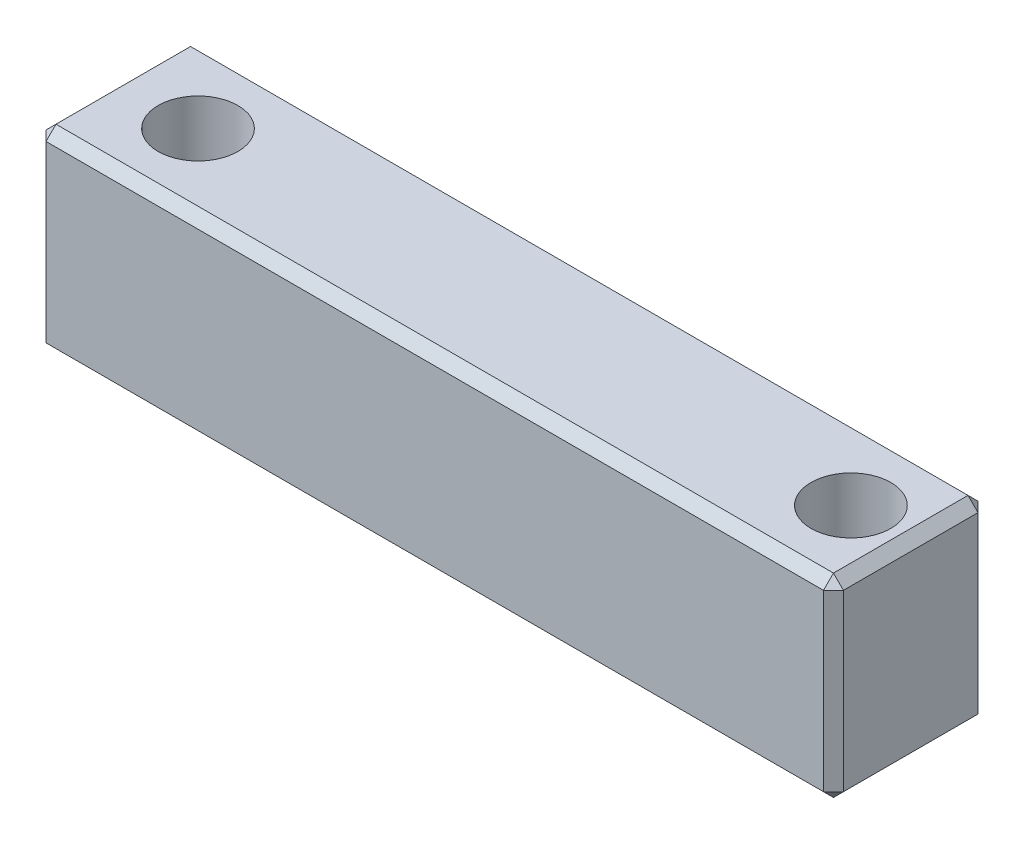
ISO-10303-21;
HEADER;
FILE_DESCRIPTION(('STEP AP214'),'2;1');
FILE_NAME('part.step','',(''),(''),'','','');
FILE_SCHEMA(('AUTOMOTIVE_DESIGN { 1 0 10303 214 1 1 1 1 }'));
ENDSEC;
DATA;
#1=APPLICATION_CONTEXT('core data for automotive mechanical design processes');
#2=APPLICATION_PROTOCOL_DEFINITION('international standard','automotive_design',2000,#1);
#3=PRODUCT_CONTEXT('',#1,'mechanical');
#4=PRODUCT('Part','Part','',(#3));
#5=PRODUCT_RELATED_PRODUCT_CATEGORY('part','',(#4));
#6=PRODUCT_DEFINITION_FORMATION('','',#4);
#7=PRODUCT_DEFINITION_CONTEXT('part definition',#1,'design');
#8=PRODUCT_DEFINITION('design','',#6,#7);
#9=PRODUCT_DEFINITION_SHAPE('','',#8);
#10=(LENGTH_UNIT() NAMED_UNIT(*) SI_UNIT(.MILLI.,.METRE.));
#11=(NAMED_UNIT(*) PLANE_ANGLE_UNIT() SI_UNIT($,.RADIAN.));
#12=(NAMED_UNIT(*) SI_UNIT($,.STERADIAN.) SOLID_ANGLE_UNIT());
#13=UNCERTAINTY_MEASURE_WITH_UNIT(LENGTH_MEASURE(1.E-05),#10,'distance_accuracy_value','');
#14=(GEOMETRIC_REPRESENTATION_CONTEXT(3) GLOBAL_UNCERTAINTY_ASSIGNED_CONTEXT((#13)) GLOBAL_UNIT_ASSIGNED_CONTEXT((#10,
#11,#12)) REPRESENTATION_CONTEXT('',''));
#15=CARTESIAN_POINT('',(0.,0.,0.));
#16=DIRECTION('',(0.,0.,1.));
#17=DIRECTION('',(1.,0.,0.));
#18=AXIS2_PLACEMENT_3D('',#15,#16,#17);
#19=CARTESIAN_POINT('',(40.,0.,0.));
#20=DIRECTION('',(0.,0.,-1.));
#21=DIRECTION('',(0.,1.,0.));
#22=AXIS2_PLACEMENT_3D('',#19,#20,#21);
#23=PLANE('',#22);
#24=DIRECTION('',(1.,0.,0.));
#25=VECTOR('',#24,1.);
#26=CARTESIAN_POINT('',(40.,0.500000000000011,0.));
#27=LINE('',#26,#25);
#28=CARTESIAN_POINT('',(0.500000000000007,0.500000000000011,0.));
#29=VERTEX_POINT('',#28);
#30=CARTESIAN_POINT('',(39.5,0.500000000000011,0.));
#31=VERTEX_POINT('',#30);
#32=EDGE_CURVE('E162',#29,#31,#27,.T.);
#33=ORIENTED_EDGE('',*,*,#32,.T.);
#34=DIRECTION('',(0.,1.,0.));
#35=VECTOR('',#34,1.);
#36=CARTESIAN_POINT('',(39.5,0.,0.));
#37=LINE('',#36,#35);
#38=CARTESIAN_POINT('',(39.5,9.24999999999999,0.));
#39=VERTEX_POINT('',#38);
#40=EDGE_CURVE('E166',#31,#39,#37,.T.);
#41=ORIENTED_EDGE('',*,*,#40,.T.);
#42=DIRECTION('',(-1.,0.,0.));
#43=VECTOR('',#42,1.);
#44=CARTESIAN_POINT('',(40.,9.24999999999999,0.));
#45=LINE('',#44,#43);
#46=CARTESIAN_POINT('',(0.500000000000007,9.24999999999999,0.));
#47=VERTEX_POINT('',#46);
#48=EDGE_CURVE('E136',#39,#47,#45,.T.);
#49=ORIENTED_EDGE('',*,*,#48,.T.);
#50=DIRECTION('',(0.,-1.,0.));
#51=VECTOR('',#50,1.);
#52=CARTESIAN_POINT('',(0.500000000000007,0.,0.));
#53=LINE('',#52,#51);
#54=EDGE_CURVE('E155',#47,#29,#53,.T.);
#55=ORIENTED_EDGE('',*,*,#54,.T.);
#56=EDGE_LOOP('',(#33,#41,#49,#55));
#57=FACE_BOUND('',#56,.T.);
#58=ADVANCED_FACE('F41',(#57),#23,.F.);
#59=CARTESIAN_POINT('',(40.,0.,0.));
#60=DIRECTION('',(0.,1.,0.));
#61=DIRECTION('',(0.,0.,1.));
#62=AXIS2_PLACEMENT_3D('',#59,#60,#61);
#63=PLANE('',#62);
#64=DIRECTION('',(0.,0.,1.));
#65=VECTOR('',#64,1.);
#66=CARTESIAN_POINT('',(39.5,0.,0.));
#67=LINE('',#66,#65);
#68=CARTESIAN_POINT('',(39.5,0.,-7.24999999999999));
#69=VERTEX_POINT('',#68);
#70=CARTESIAN_POINT('',(39.5,0.,-0.500000000000007));
#71=VERTEX_POINT('',#70);
#72=EDGE_CURVE('E192',#69,#71,#67,.T.);
#73=ORIENTED_EDGE('',*,*,#72,.T.);
#74=DIRECTION('',(-1.,0.,0.));
#75=VECTOR('',#74,1.);
#76=CARTESIAN_POINT('',(40.,0.,-0.500000000000007));
#77=LINE('',#76,#75);
#78=CARTESIAN_POINT('',(0.500000000000007,0.,-0.500000000000007));
#79=VERTEX_POINT('',#78);
#80=EDGE_CURVE('E195',#71,#79,#77,.T.);
#81=ORIENTED_EDGE('',*,*,#80,.T.);
#82=DIRECTION('',(0.,0.,-1.));
#83=VECTOR('',#82,1.);
#84=CARTESIAN_POINT('',(0.500000000000007,0.,-7.75000000000001));
#85=LINE('',#84,#83);
#86=CARTESIAN_POINT('',(0.500000000000007,0.,-7.24999999999999));
#87=VERTEX_POINT('',#86);
#88=EDGE_CURVE('E189',#79,#87,#85,.T.);
#89=ORIENTED_EDGE('',*,*,#88,.T.);
#90=DIRECTION('',(1.,0.,0.));
#91=VECTOR('',#90,1.);
#92=CARTESIAN_POINT('',(40.,0.,-7.24999999999999));
#93=LINE('',#92,#91);
#94=EDGE_CURVE('E186',#87,#69,#93,.T.);
#95=ORIENTED_EDGE('',*,*,#94,.T.);
#96=EDGE_LOOP('',(#73,#81,#89,#95));
#97=FACE_BOUND('',#96,.T.);
#98=CARTESIAN_POINT('',(4.25,0.,-3.875));
#99=DIRECTION('',(0.,1.,0.));
#100=DIRECTION('',(0.,0.,1.));
#101=AXIS2_PLACEMENT_3D('',#98,#99,#100);
#102=CIRCLE('',#101,2.);
#103=CARTESIAN_POINT('',(4.25,0.,-1.875));
#104=VERTEX_POINT('',#103);
#105=EDGE_CURVE('E163',#104,#104,#102,.F.);
#106=ORIENTED_EDGE('',*,*,#105,.F.);
#107=EDGE_LOOP('',(#106));
#108=FACE_BOUND('',#107,.T.);
#109=CARTESIAN_POINT('',(37.,0.,-3.875));
#110=DIRECTION('',(0.,1.,0.));
#111=DIRECTION('',(0.,0.,1.));
#112=AXIS2_PLACEMENT_3D('',#109,#110,#111);
#113=CIRCLE('',#112,2.);
#114=CARTESIAN_POINT('',(37.,0.,-1.875));
#115=VERTEX_POINT('',#114);
#116=EDGE_CURVE('E318',#115,#115,#113,.F.);
#117=ORIENTED_EDGE('',*,*,#116,.F.);
#118=EDGE_LOOP('',(#117));
#119=FACE_BOUND('',#118,.T.);
#120=ADVANCED_FACE('F350',(#97,#108,#119),#63,.F.);
#121=CARTESIAN_POINT('',(40.,0.,-7.75000000000001));
#122=DIRECTION('',(0.,0.,1.));
#123=DIRECTION('',(0.,-1.,0.));
#124=AXIS2_PLACEMENT_3D('',#121,#122,#123);
#125=PLANE('',#124);
#126=DIRECTION('',(0.,-1.,0.));
#127=VECTOR('',#126,1.);
#128=CARTESIAN_POINT('',(39.5,0.,-7.75000000000001));
#129=LINE('',#128,#127);
#130=CARTESIAN_POINT('',(39.5,9.24999999999999,-7.75));
#131=VERTEX_POINT('',#130);
#132=CARTESIAN_POINT('',(39.5,0.500000000000007,-7.75000000000001));
#133=VERTEX_POINT('',#132);
#134=EDGE_CURVE('E52',#131,#133,#129,.T.);
#135=ORIENTED_EDGE('',*,*,#134,.T.);
#136=DIRECTION('',(-1.,0.,0.));
#137=VECTOR('',#136,1.);
#138=CARTESIAN_POINT('',(40.,0.500000000000007,-7.75000000000001));
#139=LINE('',#138,#137);
#140=CARTESIAN_POINT('',(0.500000000000007,0.500000000000007,-7.75000000000001));
#141=VERTEX_POINT('',#140);
#142=EDGE_CURVE('E11',#133,#141,#139,.T.);
#143=ORIENTED_EDGE('',*,*,#142,.T.);
#144=DIRECTION('',(0.,1.,0.));
#145=VECTOR('',#144,1.);
#146=CARTESIAN_POINT('',(0.500000000000007,9.75,-7.75));
#147=LINE('',#146,#145);
#148=CARTESIAN_POINT('',(0.500000000000007,9.24999999999999,-7.75));
#149=VERTEX_POINT('',#148);
#150=EDGE_CURVE('E225',#141,#149,#147,.T.);
#151=ORIENTED_EDGE('',*,*,#150,.T.);
#152=DIRECTION('',(1.,0.,0.));
#153=VECTOR('',#152,1.);
#154=CARTESIAN_POINT('',(40.,9.24999999999999,-7.75));
#155=LINE('',#154,#153);
#156=EDGE_CURVE('E63',#149,#131,#155,.T.);
#157=ORIENTED_EDGE('',*,*,#156,.T.);
#158=EDGE_LOOP('',(#135,#143,#151,#157));
#159=FACE_BOUND('',#158,.T.);
#160=ADVANCED_FACE('F340',(#159),#125,.F.);
#161=CARTESIAN_POINT('',(40.,9.75,0.));
#162=DIRECTION('',(0.,-1.,0.));
#163=DIRECTION('',(0.,0.,-1.));
#164=AXIS2_PLACEMENT_3D('',#161,#162,#163);
#165=PLANE('',#164);
#166=DIRECTION('',(0.,0.,1.));
#167=VECTOR('',#166,1.);
#168=CARTESIAN_POINT('',(0.500000000000007,9.75,0.));
#169=LINE('',#168,#167);
#170=CARTESIAN_POINT('',(0.500000000000007,9.75,-7.24999999999999));
#171=VERTEX_POINT('',#170);
#172=CARTESIAN_POINT('',(0.500000000000007,9.75,-0.500000000000004));
#173=VERTEX_POINT('',#172);
#174=EDGE_CURVE('E178',#171,#173,#169,.T.);
#175=ORIENTED_EDGE('',*,*,#174,.T.);
#176=DIRECTION('',(1.,0.,0.));
#177=VECTOR('',#176,1.);
#178=CARTESIAN_POINT('',(40.,9.75,-0.500000000000004));
#179=LINE('',#178,#177);
#180=CARTESIAN_POINT('',(39.5,9.75,-0.500000000000004));
#181=VERTEX_POINT('',#180);
#182=EDGE_CURVE('E138',#173,#181,#179,.T.);
#183=ORIENTED_EDGE('',*,*,#182,.T.);
#184=DIRECTION('',(0.,0.,-1.));
#185=VECTOR('',#184,1.);
#186=CARTESIAN_POINT('',(39.5,9.75,0.));
#187=LINE('',#186,#185);
#188=CARTESIAN_POINT('',(39.5,9.75,-7.24999999999999));
#189=VERTEX_POINT('',#188);
#190=EDGE_CURVE('E181',#181,#189,#187,.T.);
#191=ORIENTED_EDGE('',*,*,#190,.T.);
#192=DIRECTION('',(-1.,0.,0.));
#193=VECTOR('',#192,1.);
#194=CARTESIAN_POINT('',(40.,9.75,-7.24999999999999));
#195=LINE('',#194,#193);
#196=EDGE_CURVE('E172',#189,#171,#195,.T.);
#197=ORIENTED_EDGE('',*,*,#196,.T.);
#198=EDGE_LOOP('',(#175,#183,#191,#197));
#199=FACE_BOUND('',#198,.T.);
#200=CARTESIAN_POINT('',(4.25,9.75,-3.875));
#201=DIRECTION('',(0.,1.,0.));
#202=DIRECTION('',(0.,0.,1.));
#203=AXIS2_PLACEMENT_3D('',#200,#201,#202);
#204=CIRCLE('',#203,2.);
#205=CARTESIAN_POINT('',(4.25,9.75,-1.875));
#206=VERTEX_POINT('',#205);
#207=EDGE_CURVE('E324',#206,#206,#204,.T.);
#208=ORIENTED_EDGE('',*,*,#207,.F.);
#209=EDGE_LOOP('',(#208));
#210=FACE_BOUND('',#209,.T.);
#211=CARTESIAN_POINT('',(37.,9.75,-3.875));
#212=DIRECTION('',(0.,1.,0.));
#213=DIRECTION('',(0.,0.,1.));
#214=AXIS2_PLACEMENT_3D('',#211,#212,#213);
#215=CIRCLE('',#214,2.);
#216=CARTESIAN_POINT('',(37.,9.75,-1.875));
#217=VERTEX_POINT('',#216);
#218=EDGE_CURVE('E311',#217,#217,#215,.T.);
#219=ORIENTED_EDGE('',*,*,#218,.F.);
#220=EDGE_LOOP('',(#219));
#221=FACE_BOUND('',#220,.T.);
#222=ADVANCED_FACE('F336',(#199,#210,#221),#165,.F.);
#223=CARTESIAN_POINT('',(40.,0.,0.));
#224=DIRECTION('',(-1.,0.,0.));
#225=DIRECTION('',(0.,0.,1.));
#226=AXIS2_PLACEMENT_3D('',#223,#224,#225);
#227=PLANE('',#226);
#228=DIRECTION('',(0.,1.,0.));
#229=VECTOR('',#228,1.);
#230=CARTESIAN_POINT('',(40.,0.,-7.24999999999999));
#231=LINE('',#230,#229);
#232=CARTESIAN_POINT('',(40.,0.500000000000007,-7.24999999999999));
#233=VERTEX_POINT('',#232);
#234=CARTESIAN_POINT('',(40.,9.24999999999999,-7.24999999999999));
#235=VERTEX_POINT('',#234);
#236=EDGE_CURVE('E199',#233,#235,#231,.T.);
#237=ORIENTED_EDGE('',*,*,#236,.T.);
#238=DIRECTION('',(0.,0.,1.));
#239=VECTOR('',#238,1.);
#240=CARTESIAN_POINT('',(40.,9.24999999999999,0.));
#241=LINE('',#240,#239);
#242=CARTESIAN_POINT('',(40.,9.24999999999999,-0.500000000000001));
#243=VERTEX_POINT('',#242);
#244=EDGE_CURVE('E208',#235,#243,#241,.T.);
#245=ORIENTED_EDGE('',*,*,#244,.T.);
#246=DIRECTION('',(0.,-1.,0.));
#247=VECTOR('',#246,1.);
#248=CARTESIAN_POINT('',(40.,0.,-0.500000000000007));
#249=LINE('',#248,#247);
#250=CARTESIAN_POINT('',(40.,0.500000000000007,-0.500000000000007));
#251=VERTEX_POINT('',#250);
#252=EDGE_CURVE('E205',#243,#251,#249,.T.);
#253=ORIENTED_EDGE('',*,*,#252,.T.);
#254=DIRECTION('',(0.,0.,-1.));
#255=VECTOR('',#254,1.);
#256=CARTESIAN_POINT('',(40.,0.500000000000007,0.));
#257=LINE('',#256,#255);
#258=EDGE_CURVE('E202',#251,#233,#257,.T.);
#259=ORIENTED_EDGE('',*,*,#258,.T.);
#260=EDGE_LOOP('',(#237,#245,#253,#259));
#261=FACE_BOUND('',#260,.T.);
#262=ADVANCED_FACE('F339',(#261),#227,.F.);
#263=CARTESIAN_POINT('',(0.,0.,0.));
#264=DIRECTION('',(-1.,0.,0.));
#265=DIRECTION('',(0.,0.,1.));
#266=AXIS2_PLACEMENT_3D('',#263,#264,#265);
#267=PLANE('',#266);
#268=DIRECTION('',(0.,-1.,0.));
#269=VECTOR('',#268,1.);
#270=CARTESIAN_POINT('',(0.,0.,-7.24999999999999));
#271=LINE('',#270,#269);
#272=CARTESIAN_POINT('',(0.,9.24999999999999,-7.24999999999999));
#273=VERTEX_POINT('',#272);
#274=CARTESIAN_POINT('',(0.,0.500000000000011,-7.24999999999999));
#275=VERTEX_POINT('',#274);
#276=EDGE_CURVE('E212',#273,#275,#271,.T.);
#277=ORIENTED_EDGE('',*,*,#276,.T.);
#278=DIRECTION('',(0.,0.,1.));
#279=VECTOR('',#278,1.);
#280=CARTESIAN_POINT('',(0.,0.500000000000011,0.));
#281=LINE('',#280,#279);
#282=CARTESIAN_POINT('',(0.,0.500000000000011,-0.50000000000001));
#283=VERTEX_POINT('',#282);
#284=EDGE_CURVE('E221',#275,#283,#281,.T.);
#285=ORIENTED_EDGE('',*,*,#284,.T.);
#286=DIRECTION('',(0.,1.,0.));
#287=VECTOR('',#286,1.);
#288=CARTESIAN_POINT('',(0.,9.75,-0.500000000000004));
#289=LINE('',#288,#287);
#290=CARTESIAN_POINT('',(0.,9.24999999999999,-0.500000000000004));
#291=VERTEX_POINT('',#290);
#292=EDGE_CURVE('E218',#283,#291,#289,.T.);
#293=ORIENTED_EDGE('',*,*,#292,.T.);
#294=DIRECTION('',(0.,0.,-1.));
#295=VECTOR('',#294,1.);
#296=CARTESIAN_POINT('',(0.,9.24999999999999,-7.75));
#297=LINE('',#296,#295);
#298=EDGE_CURVE('E215',#291,#273,#297,.T.);
#299=ORIENTED_EDGE('',*,*,#298,.T.);
#300=EDGE_LOOP('',(#277,#285,#293,#299));
#301=FACE_BOUND('',#300,.T.);
#302=ADVANCED_FACE('F347',(#301),#267,.T.);
#303=CARTESIAN_POINT('',(37.,-5.65685424949238,-3.875));
#304=DIRECTION('',(0.,1.,0.));
#305=DIRECTION('',(0.,0.,1.));
#306=AXIS2_PLACEMENT_3D('',#303,#304,#305);
#307=CYLINDRICAL_SURFACE('',#306,2.);
#308=ORIENTED_EDGE('',*,*,#116,.T.);
#309=EDGE_LOOP('',(#308));
#310=FACE_BOUND('',#309,.T.);
#311=ORIENTED_EDGE('',*,*,#218,.T.);
#312=EDGE_LOOP('',(#311));
#313=FACE_BOUND('',#312,.T.);
#314=ADVANCED_FACE('F518',(#310,#313),#307,.F.);
#315=CARTESIAN_POINT('',(4.25,-5.65685424949238,-3.875));
#316=DIRECTION('',(0.,1.,0.));
#317=DIRECTION('',(0.,0.,1.));
#318=AXIS2_PLACEMENT_3D('',#315,#316,#317);
#319=CYLINDRICAL_SURFACE('',#318,2.);
#320=ORIENTED_EDGE('',*,*,#105,.T.);
#321=EDGE_LOOP('',(#320));
#322=FACE_BOUND('',#321,.T.);
#323=ORIENTED_EDGE('',*,*,#207,.T.);
#324=EDGE_LOOP('',(#323));
#325=FACE_BOUND('',#324,.T.);
#326=ADVANCED_FACE('F334',(#322,#325),#319,.F.);
#327=CARTESIAN_POINT('',(40.,0.500000000000008,-7.75000000000001));
#328=DIRECTION('',(0.,0.70710678118655,0.707106781186545));
#329=DIRECTION('',(-1.,0.,0.));
#330=AXIS2_PLACEMENT_3D('',#327,#328,#329);
#331=PLANE('',#330);
#332=DIRECTION('',(0.,-0.707106781186545,0.70710678118655));
#333=VECTOR('',#332,1.);
#334=CARTESIAN_POINT('',(39.5,0.250000000000002,-7.5));
#335=LINE('',#334,#333);
#336=EDGE_CURVE('E46',#69,#133,#335,.F.);
#337=ORIENTED_EDGE('',*,*,#336,.F.);
#338=ORIENTED_EDGE('',*,*,#94,.F.);
#339=DIRECTION('',(0.,0.707106781186545,-0.70710678118655));
#340=VECTOR('',#339,1.);
#341=CARTESIAN_POINT('',(0.500000000000007,0.,-7.24999999999999));
#342=LINE('',#341,#340);
#343=EDGE_CURVE('E302',#141,#87,#342,.F.);
#344=ORIENTED_EDGE('',*,*,#343,.F.);
#345=ORIENTED_EDGE('',*,*,#142,.F.);
#346=EDGE_LOOP('',(#337,#338,#344,#345));
#347=FACE_BOUND('',#346,.T.);
#348=ADVANCED_FACE('F44',(#347),#331,.F.);
#349=CARTESIAN_POINT('',(40.,0.500000000000007,-7.24999999999999));
#350=DIRECTION('',(0.577350269189627,-0.577350269189627,-0.577350269189623));
#351=DIRECTION('',(0.707106781186547,0.707106781186547,0.));
#352=AXIS2_PLACEMENT_3D('',#349,#350,#351);
#353=PLANE('',#352);
#354=DIRECTION('',(0.707106781186548,0.707106781186548,0.));
#355=VECTOR('',#354,1.);
#356=CARTESIAN_POINT('',(40.,0.500000000000007,-7.24999999999999));
#357=LINE('',#356,#355);
#358=EDGE_CURVE('E295',#69,#233,#357,.T.);
#359=ORIENTED_EDGE('',*,*,#358,.F.);
#360=ORIENTED_EDGE('',*,*,#336,.T.);
#361=DIRECTION('',(-0.707106781186545,0.,-0.70710678118655));
#362=VECTOR('',#361,1.);
#363=CARTESIAN_POINT('',(40.,0.500000000000007,-7.24999999999999));
#364=LINE('',#363,#362);
#365=EDGE_CURVE('E299',#233,#133,#364,.T.);
#366=ORIENTED_EDGE('',*,*,#365,.F.);
#367=EDGE_LOOP('',(#359,#360,#366));
#368=FACE_BOUND('',#367,.T.);
#369=ADVANCED_FACE('F480',(#368),#353,.T.);
#370=CARTESIAN_POINT('',(0.500000000000007,0.,-7.24999999999999));
#371=DIRECTION('',(-0.57735026918963,-0.577350269189626,-0.577350269189622));
#372=DIRECTION('',(0.707106781186545,-0.70710678118655,0.));
#373=AXIS2_PLACEMENT_3D('',#370,#371,#372);
#374=PLANE('',#373);
#375=DIRECTION('',(0.707106781186545,0.,-0.70710678118655));
#376=VECTOR('',#375,1.);
#377=CARTESIAN_POINT('',(0.250000000000004,0.500000000000009,-7.5));
#378=LINE('',#377,#376);
#379=EDGE_CURVE('E287',#141,#275,#378,.F.);
#380=ORIENTED_EDGE('',*,*,#379,.F.);
#381=ORIENTED_EDGE('',*,*,#343,.T.);
#382=DIRECTION('',(-0.707106781186545,0.70710678118655,0.));
#383=VECTOR('',#382,1.);
#384=CARTESIAN_POINT('',(0.500000000000007,0.,-7.24999999999999));
#385=LINE('',#384,#383);
#386=EDGE_CURVE('E291',#275,#87,#385,.F.);
#387=ORIENTED_EDGE('',*,*,#386,.F.);
#388=EDGE_LOOP('',(#380,#381,#387));
#389=FACE_BOUND('',#388,.T.);
#390=ADVANCED_FACE('F474',(#389),#374,.T.);
#391=CARTESIAN_POINT('',(40.,0.,-7.24999999999999));
#392=DIRECTION('',(-0.70710678118655,0.,0.707106781186545));
#393=DIRECTION('',(0.,1.,0.));
#394=AXIS2_PLACEMENT_3D('',#391,#392,#393);
#395=PLANE('',#394);
#396=ORIENTED_EDGE('',*,*,#365,.T.);
#397=ORIENTED_EDGE('',*,*,#134,.F.);
#398=DIRECTION('',(0.707106781186545,0.,0.70710678118655));
#399=VECTOR('',#398,1.);
#400=CARTESIAN_POINT('',(39.75,9.24999999999999,-7.49999999999999));
#401=LINE('',#400,#399);
#402=EDGE_CURVE('E279',#235,#131,#401,.F.);
#403=ORIENTED_EDGE('',*,*,#402,.F.);
#404=ORIENTED_EDGE('',*,*,#236,.F.);
#405=EDGE_LOOP('',(#396,#397,#403,#404));
#406=FACE_BOUND('',#405,.T.);
#407=ADVANCED_FACE('F467',(#406),#395,.F.);
#408=CARTESIAN_POINT('',(40.,0.500000000000007,0.));
#409=DIRECTION('',(-0.707106781186547,0.707106781186547,0.));
#410=DIRECTION('',(0.,0.,-1.));
#411=AXIS2_PLACEMENT_3D('',#408,#409,#410);
#412=PLANE('',#411);
#413=ORIENTED_EDGE('',*,*,#358,.T.);
#414=ORIENTED_EDGE('',*,*,#258,.F.);
#415=DIRECTION('',(-0.707106781186548,-0.707106781186548,0.));
#416=VECTOR('',#415,1.);
#417=CARTESIAN_POINT('',(39.75,0.250000000000005,-0.500000000000007));
#418=LINE('',#417,#416);
#419=EDGE_CURVE('E275',#71,#251,#418,.F.);
#420=ORIENTED_EDGE('',*,*,#419,.F.);
#421=ORIENTED_EDGE('',*,*,#72,.F.);
#422=EDGE_LOOP('',(#413,#414,#420,#421));
#423=FACE_BOUND('',#422,.T.);
#424=ADVANCED_FACE('F460',(#423),#412,.F.);
#425=CARTESIAN_POINT('',(40.,0.,-0.500000000000007));
#426=DIRECTION('',(0.,0.707106781186545,-0.70710678118655));
#427=DIRECTION('',(-1.,0.,0.));
#428=AXIS2_PLACEMENT_3D('',#425,#426,#427);
#429=PLANE('',#428);
#430=DIRECTION('',(0.,-0.70710678118655,-0.707106781186545));
#431=VECTOR('',#430,1.);
#432=CARTESIAN_POINT('',(0.500000000000007,0.,-0.500000000000007));
#433=LINE('',#432,#431);
#434=EDGE_CURVE('E267',#79,#29,#433,.F.);
#435=ORIENTED_EDGE('',*,*,#434,.F.);
#436=ORIENTED_EDGE('',*,*,#80,.F.);
#437=DIRECTION('',(0.,0.70710678118655,0.707106781186545));
#438=VECTOR('',#437,1.);
#439=CARTESIAN_POINT('',(39.5,0.500000000000011,0.));
#440=LINE('',#439,#438);
#441=EDGE_CURVE('E271',#31,#71,#440,.F.);
#442=ORIENTED_EDGE('',*,*,#441,.F.);
#443=ORIENTED_EDGE('',*,*,#32,.F.);
#444=EDGE_LOOP('',(#435,#436,#442,#443));
#445=FACE_BOUND('',#444,.T.);
#446=ADVANCED_FACE('F453',(#445),#429,.F.);
#447=CARTESIAN_POINT('',(0.500000000000007,0.,0.));
#448=DIRECTION('',(-0.70710678118655,-0.707106781186545,0.));
#449=DIRECTION('',(0.,0.,1.));
#450=AXIS2_PLACEMENT_3D('',#447,#448,#449);
#451=PLANE('',#450);
#452=ORIENTED_EDGE('',*,*,#386,.T.);
#453=ORIENTED_EDGE('',*,*,#88,.F.);
#454=DIRECTION('',(0.707106781186545,-0.70710678118655,0.));
#455=VECTOR('',#454,1.);
#456=CARTESIAN_POINT('',(0.500000000000007,0.,-0.500000000000007));
#457=LINE('',#456,#455);
#458=EDGE_CURVE('E264',#283,#79,#457,.T.);
#459=ORIENTED_EDGE('',*,*,#458,.F.);
#460=ORIENTED_EDGE('',*,*,#284,.F.);
#461=EDGE_LOOP('',(#452,#453,#459,#460));
#462=FACE_BOUND('',#461,.T.);
#463=ADVANCED_FACE('F446',(#462),#451,.T.);
#464=CARTESIAN_POINT('',(0.500000000000007,0.,-7.75000000000001));
#465=DIRECTION('',(-0.70710678118655,0.,-0.707106781186545));
#466=DIRECTION('',(0.,-1.,0.));
#467=AXIS2_PLACEMENT_3D('',#464,#465,#466);
#468=PLANE('',#467);
#469=ORIENTED_EDGE('',*,*,#379,.T.);
#470=ORIENTED_EDGE('',*,*,#276,.F.);
#471=DIRECTION('',(-0.707106781186545,0.,0.70710678118655));
#472=VECTOR('',#471,1.);
#473=CARTESIAN_POINT('',(0.,9.24999999999999,-7.24999999999999));
#474=LINE('',#473,#472);
#475=EDGE_CURVE('E260',#149,#273,#474,.T.);
#476=ORIENTED_EDGE('',*,*,#475,.F.);
#477=ORIENTED_EDGE('',*,*,#150,.F.);
#478=EDGE_LOOP('',(#469,#470,#476,#477));
#479=FACE_BOUND('',#478,.T.);
#480=ADVANCED_FACE('F439',(#479),#468,.T.);
#481=CARTESIAN_POINT('',(40.,9.75,-7.24999999999999));
#482=DIRECTION('',(0.,-0.70710678118655,0.707106781186545));
#483=DIRECTION('',(-1.,0.,0.));
#484=AXIS2_PLACEMENT_3D('',#481,#482,#483);
#485=PLANE('',#484);
#486=DIRECTION('',(0.,-0.707106781186545,-0.70710678118655));
#487=VECTOR('',#486,1.);
#488=CARTESIAN_POINT('',(39.5,9.75,-7.24999999999999));
#489=LINE('',#488,#487);
#490=EDGE_CURVE('E283',#131,#189,#489,.F.);
#491=ORIENTED_EDGE('',*,*,#490,.F.);
#492=ORIENTED_EDGE('',*,*,#156,.F.);
#493=DIRECTION('',(0.,0.707106781186545,0.70710678118655));
#494=VECTOR('',#493,1.);
#495=CARTESIAN_POINT('',(0.500000000000007,9.5,-7.49999999999999));
#496=LINE('',#495,#494);
#497=EDGE_CURVE('E256',#171,#149,#496,.F.);
#498=ORIENTED_EDGE('',*,*,#497,.F.);
#499=ORIENTED_EDGE('',*,*,#196,.F.);
#500=EDGE_LOOP('',(#491,#492,#498,#499));
#501=FACE_BOUND('',#500,.T.);
#502=ADVANCED_FACE('F432',(#501),#485,.F.);
#503=CARTESIAN_POINT('',(39.5,9.75,-7.24999999999999));
#504=DIRECTION('',(0.577350269189627,0.577350269189627,-0.577350269189623));
#505=DIRECTION('',(-0.707106781186547,0.707106781186547,0.));
#506=AXIS2_PLACEMENT_3D('',#503,#504,#505);
#507=PLANE('',#506);
#508=ORIENTED_EDGE('',*,*,#402,.T.);
#509=ORIENTED_EDGE('',*,*,#490,.T.);
#510=DIRECTION('',(-0.707106781186548,0.707106781186548,0.));
#511=VECTOR('',#510,1.);
#512=CARTESIAN_POINT('',(39.5,9.75,-7.24999999999999));
#513=LINE('',#512,#511);
#514=EDGE_CURVE('E252',#235,#189,#513,.T.);
#515=ORIENTED_EDGE('',*,*,#514,.F.);
#516=EDGE_LOOP('',(#508,#509,#515));
#517=FACE_BOUND('',#516,.T.);
#518=ADVANCED_FACE('F425',(#517),#507,.T.);
#519=CARTESIAN_POINT('',(39.5,0.500000000000011,0.));
#520=DIRECTION('',(0.577350269189625,-0.577350269189625,0.577350269189628));
#521=DIRECTION('',(0.,-0.70710678118655,-0.707106781186545));
#522=AXIS2_PLACEMENT_3D('',#519,#520,#521);
#523=PLANE('',#522);
#524=ORIENTED_EDGE('',*,*,#441,.T.);
#525=ORIENTED_EDGE('',*,*,#419,.T.);
#526=DIRECTION('',(0.707106781186548,0.,-0.707106781186548));
#527=VECTOR('',#526,1.);
#528=CARTESIAN_POINT('',(39.5,0.500000000000011,0.));
#529=LINE('',#528,#527);
#530=EDGE_CURVE('E248',#31,#251,#529,.T.);
#531=ORIENTED_EDGE('',*,*,#530,.F.);
#532=EDGE_LOOP('',(#524,#525,#531));
#533=FACE_BOUND('',#532,.T.);
#534=ADVANCED_FACE('F418',(#533),#523,.T.);
#535=CARTESIAN_POINT('',(0.500000000000007,0.,-0.500000000000007));
#536=DIRECTION('',(-0.57735026918963,-0.577350269189622,0.577350269189626));
#537=DIRECTION('',(0.707106781186545,0.,0.70710678118655));
#538=AXIS2_PLACEMENT_3D('',#535,#536,#537);
#539=PLANE('',#538);
#540=ORIENTED_EDGE('',*,*,#458,.T.);
#541=ORIENTED_EDGE('',*,*,#434,.T.);
#542=DIRECTION('',(-0.707106781186545,0.,-0.70710678118655));
#543=VECTOR('',#542,1.);
#544=CARTESIAN_POINT('',(0.250000000000004,0.500000000000011,-0.250000000000005));
#545=LINE('',#544,#543);
#546=EDGE_CURVE('E158',#283,#29,#545,.F.);
#547=ORIENTED_EDGE('',*,*,#546,.F.);
#548=EDGE_LOOP('',(#540,#541,#547));
#549=FACE_BOUND('',#548,.T.);
#550=ADVANCED_FACE('F411',(#549),#539,.T.);
#551=CARTESIAN_POINT('',(0.,9.24999999999999,-7.24999999999999));
#552=DIRECTION('',(-0.57735026918963,0.577350269189626,-0.577350269189622));
#553=DIRECTION('',(-0.707106781186545,-0.70710678118655,0.));
#554=AXIS2_PLACEMENT_3D('',#551,#552,#553);
#555=PLANE('',#554);
#556=ORIENTED_EDGE('',*,*,#497,.T.);
#557=ORIENTED_EDGE('',*,*,#475,.T.);
#558=DIRECTION('',(0.707106781186545,0.70710678118655,0.));
#559=VECTOR('',#558,1.);
#560=CARTESIAN_POINT('',(0.,9.24999999999999,-7.24999999999999));
#561=LINE('',#560,#559);
#562=EDGE_CURVE('E242',#171,#273,#561,.F.);
#563=ORIENTED_EDGE('',*,*,#562,.F.);
#564=EDGE_LOOP('',(#556,#557,#563));
#565=FACE_BOUND('',#564,.T.);
#566=ADVANCED_FACE('F404',(#565),#555,.T.);
#567=CARTESIAN_POINT('',(40.,9.24999999999999,0.));
#568=DIRECTION('',(-0.707106781186547,-0.707106781186547,0.));
#569=DIRECTION('',(0.,0.,1.));
#570=AXIS2_PLACEMENT_3D('',#567,#568,#569);
#571=PLANE('',#570);
#572=ORIENTED_EDGE('',*,*,#514,.T.);
#573=ORIENTED_EDGE('',*,*,#190,.F.);
#574=DIRECTION('',(0.707106781186548,-0.707106781186548,0.));
#575=VECTOR('',#574,1.);
#576=CARTESIAN_POINT('',(39.5,9.75,-0.500000000000004));
#577=LINE('',#576,#575);
#578=EDGE_CURVE('E238',#243,#181,#577,.F.);
#579=ORIENTED_EDGE('',*,*,#578,.F.);
#580=ORIENTED_EDGE('',*,*,#244,.F.);
#581=EDGE_LOOP('',(#572,#573,#579,#580));
#582=FACE_BOUND('',#581,.T.);
#583=ADVANCED_FACE('F397',(#582),#571,.F.);
#584=CARTESIAN_POINT('',(40.,0.,-0.500000000000007));
#585=DIRECTION('',(-0.707106781186547,0.,-0.707106781186547));
#586=DIRECTION('',(0.,-1.,0.));
#587=AXIS2_PLACEMENT_3D('',#584,#585,#586);
#588=PLANE('',#587);
#589=ORIENTED_EDGE('',*,*,#530,.T.);
#590=ORIENTED_EDGE('',*,*,#252,.F.);
#591=DIRECTION('',(-0.707106781186547,0.,0.707106781186547));
#592=VECTOR('',#591,1.);
#593=CARTESIAN_POINT('',(39.75,9.24999999999999,-0.249999999999999));
#594=LINE('',#593,#592);
#595=EDGE_CURVE('E152',#39,#243,#594,.F.);
#596=ORIENTED_EDGE('',*,*,#595,.F.);
#597=ORIENTED_EDGE('',*,*,#40,.F.);
#598=EDGE_LOOP('',(#589,#590,#596,#597));
#599=FACE_BOUND('',#598,.T.);
#600=ADVANCED_FACE('F391',(#599),#588,.F.);
#601=CARTESIAN_POINT('',(0.500000000000007,0.,0.));
#602=DIRECTION('',(-0.70710678118655,0.,0.707106781186545));
#603=DIRECTION('',(0.,1.,0.));
#604=AXIS2_PLACEMENT_3D('',#601,#602,#603);
#605=PLANE('',#604);
#606=ORIENTED_EDGE('',*,*,#546,.T.);
#607=ORIENTED_EDGE('',*,*,#54,.F.);
#608=DIRECTION('',(0.707106781186545,0.,0.70710678118655));
#609=VECTOR('',#608,1.);
#610=CARTESIAN_POINT('',(0.500000000000007,9.24999999999999,0.));
#611=LINE('',#610,#609);
#612=EDGE_CURVE('E145',#291,#47,#611,.T.);
#613=ORIENTED_EDGE('',*,*,#612,.F.);
#614=ORIENTED_EDGE('',*,*,#292,.F.);
#615=EDGE_LOOP('',(#606,#607,#613,#614));
#616=FACE_BOUND('',#615,.T.);
#617=ADVANCED_FACE('F156',(#616),#605,.T.);
#618=CARTESIAN_POINT('',(0.500000000000007,9.75,0.));
#619=DIRECTION('',(-0.70710678118655,0.707106781186545,0.));
#620=DIRECTION('',(0.,0.,-1.));
#621=AXIS2_PLACEMENT_3D('',#618,#619,#620);
#622=PLANE('',#621);
#623=ORIENTED_EDGE('',*,*,#562,.T.);
#624=ORIENTED_EDGE('',*,*,#298,.F.);
#625=DIRECTION('',(-0.707106781186545,-0.70710678118655,0.));
#626=VECTOR('',#625,1.);
#627=CARTESIAN_POINT('',(0.250000000000004,9.49999999999999,-0.500000000000004));
#628=LINE('',#627,#626);
#629=EDGE_CURVE('E149',#173,#291,#628,.T.);
#630=ORIENTED_EDGE('',*,*,#629,.F.);
#631=ORIENTED_EDGE('',*,*,#174,.F.);
#632=EDGE_LOOP('',(#623,#624,#630,#631));
#633=FACE_BOUND('',#632,.T.);
#634=ADVANCED_FACE('F378',(#633),#622,.T.);
#635=CARTESIAN_POINT('',(39.5,9.75,-0.500000000000004));
#636=DIRECTION('',(0.577350269189624,0.577350269189628,0.577350269189625));
#637=DIRECTION('',(0.,-0.707106781186545,0.70710678118655));
#638=AXIS2_PLACEMENT_3D('',#635,#636,#637);
#639=PLANE('',#638);
#640=ORIENTED_EDGE('',*,*,#595,.T.);
#641=ORIENTED_EDGE('',*,*,#578,.T.);
#642=DIRECTION('',(0.,0.707106781186545,-0.70710678118655));
#643=VECTOR('',#642,1.);
#644=CARTESIAN_POINT('',(39.5,9.75,-0.500000000000004));
#645=LINE('',#644,#643);
#646=EDGE_CURVE('E142',#39,#181,#645,.T.);
#647=ORIENTED_EDGE('',*,*,#646,.F.);
#648=EDGE_LOOP('',(#640,#641,#647));
#649=FACE_BOUND('',#648,.T.);
#650=ADVANCED_FACE('F372',(#649),#639,.T.);
#651=CARTESIAN_POINT('',(0.500000000000007,9.24999999999999,0.));
#652=DIRECTION('',(-0.57735026918963,0.577350269189626,0.577350269189622));
#653=DIRECTION('',(-0.707106781186545,-0.70710678118655,0.));
#654=AXIS2_PLACEMENT_3D('',#651,#652,#653);
#655=PLANE('',#654);
#656=ORIENTED_EDGE('',*,*,#629,.T.);
#657=ORIENTED_EDGE('',*,*,#612,.T.);
#658=DIRECTION('',(0.,-0.707106781186545,0.70710678118655));
#659=VECTOR('',#658,1.);
#660=CARTESIAN_POINT('',(0.500000000000007,9.24999999999999,0.));
#661=LINE('',#660,#659);
#662=EDGE_CURVE('E132',#173,#47,#661,.T.);
#663=ORIENTED_EDGE('',*,*,#662,.F.);
#664=EDGE_LOOP('',(#656,#657,#663));
#665=FACE_BOUND('',#664,.T.);
#666=ADVANCED_FACE('F147',(#665),#655,.T.);
#667=CARTESIAN_POINT('',(40.,9.24999999999999,0.));
#668=DIRECTION('',(0.,-0.70710678118655,-0.707106781186545));
#669=DIRECTION('',(-1.,0.,0.));
#670=AXIS2_PLACEMENT_3D('',#667,#668,#669);
#671=PLANE('',#670);
#672=ORIENTED_EDGE('',*,*,#646,.T.);
#673=ORIENTED_EDGE('',*,*,#182,.F.);
#674=ORIENTED_EDGE('',*,*,#662,.T.);
#675=ORIENTED_EDGE('',*,*,#48,.F.);
#676=EDGE_LOOP('',(#672,#673,#674,#675));
#677=FACE_BOUND('',#676,.T.);
#678=ADVANCED_FACE('F134',(#677),#671,.F.);
#679=CLOSED_SHELL('',(#58,#120,#160,#222,#262,#302,#314,#326,#348,#369,#390,#407,#424,#446,#463,
#480,#502,#518,#534,#550,#566,#583,#600,#617,#634,#650,#666,#678));
#680=MANIFOLD_SOLID_BREP('B2',#679);
#681=ADVANCED_BREP_SHAPE_REPRESENTATION('',(#18,#680),#14);
#682=SHAPE_DEFINITION_REPRESENTATION(#9,#681);
ENDSEC;
END-ISO-10303-21;
